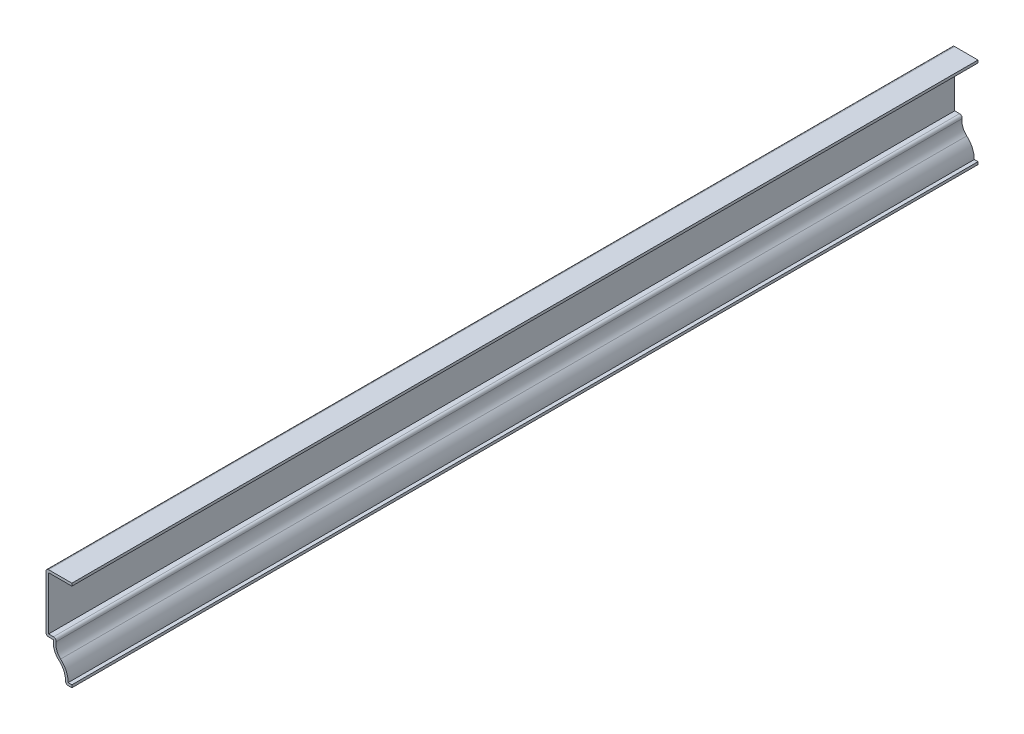
ISO-10303-21;
HEADER;
FILE_DESCRIPTION(('STEP AP214'),'2;1');
FILE_NAME('part.step','',(''),(''),'','','');
FILE_SCHEMA(('AUTOMOTIVE_DESIGN { 1 0 10303 214 1 1 1 1 }'));
ENDSEC;
DATA;
#1=APPLICATION_CONTEXT('core data for automotive mechanical design processes');
#2=APPLICATION_PROTOCOL_DEFINITION('international standard','automotive_design',2000,#1);
#3=PRODUCT_CONTEXT('',#1,'mechanical');
#4=PRODUCT('Part','Part','',(#3));
#5=PRODUCT_RELATED_PRODUCT_CATEGORY('part','',(#4));
#6=PRODUCT_DEFINITION_FORMATION('','',#4);
#7=PRODUCT_DEFINITION_CONTEXT('part definition',#1,'design');
#8=PRODUCT_DEFINITION('design','',#6,#7);
#9=PRODUCT_DEFINITION_SHAPE('','',#8);
#10=(LENGTH_UNIT() NAMED_UNIT(*) SI_UNIT(.MILLI.,.METRE.));
#11=(NAMED_UNIT(*) PLANE_ANGLE_UNIT() SI_UNIT($,.RADIAN.));
#12=(NAMED_UNIT(*) SI_UNIT($,.STERADIAN.) SOLID_ANGLE_UNIT());
#13=UNCERTAINTY_MEASURE_WITH_UNIT(LENGTH_MEASURE(1.E-05),#10,'distance_accuracy_value','');
#14=(GEOMETRIC_REPRESENTATION_CONTEXT(3) GLOBAL_UNCERTAINTY_ASSIGNED_CONTEXT((#13)) GLOBAL_UNIT_ASSIGNED_CONTEXT((#10,
#11,#12)) REPRESENTATION_CONTEXT('',''));
#15=CARTESIAN_POINT('',(0.,0.,0.));
#16=DIRECTION('',(0.,0.,1.));
#17=DIRECTION('',(1.,0.,0.));
#18=AXIS2_PLACEMENT_3D('',#15,#16,#17);
#19=CARTESIAN_POINT('',(-12.7,43.18,-444.5));
#20=DIRECTION('',(0.,-1.,0.));
#21=DIRECTION('',(0.,0.,-1.));
#22=AXIS2_PLACEMENT_3D('',#19,#20,#21);
#23=PLANE('',#22);
#24=DIRECTION('',(1.,0.,0.));
#25=VECTOR('',#24,1.);
#26=CARTESIAN_POINT('',(-12.7,43.18,0.));
#27=LINE('',#26,#25);
#28=CARTESIAN_POINT('',(-11.43,43.18,0.));
#29=VERTEX_POINT('',#28);
#30=CARTESIAN_POINT('',(0.,43.18,0.));
#31=VERTEX_POINT('',#30);
#32=EDGE_CURVE('E218',#29,#31,#27,.T.);
#33=ORIENTED_EDGE('',*,*,#32,.F.);
#34=DIRECTION('',(0.,0.,1.));
#35=VECTOR('',#34,1.);
#36=CARTESIAN_POINT('',(-11.43,43.18,-444.5));
#37=LINE('',#36,#35);
#38=CARTESIAN_POINT('',(-11.43,43.18,-444.5));
#39=VERTEX_POINT('',#38);
#40=EDGE_CURVE('E185',#39,#29,#37,.T.);
#41=ORIENTED_EDGE('',*,*,#40,.F.);
#42=DIRECTION('',(1.,0.,0.));
#43=VECTOR('',#42,1.);
#44=CARTESIAN_POINT('',(-12.7,43.18,-444.5));
#45=LINE('',#44,#43);
#46=CARTESIAN_POINT('',(0.,43.18,-444.5));
#47=VERTEX_POINT('',#46);
#48=EDGE_CURVE('E167',#39,#47,#45,.T.);
#49=ORIENTED_EDGE('',*,*,#48,.T.);
#50=DIRECTION('',(0.,0.,1.));
#51=VECTOR('',#50,1.);
#52=CARTESIAN_POINT('',(0.,43.18,-444.5));
#53=LINE('',#52,#51);
#54=EDGE_CURVE('E175',#47,#31,#53,.T.);
#55=ORIENTED_EDGE('',*,*,#54,.T.);
#56=EDGE_LOOP('',(#33,#41,#49,#55));
#57=FACE_BOUND('',#56,.T.);
#58=ADVANCED_FACE('F35',(#57),#23,.T.);
#59=CARTESIAN_POINT('',(-11.43,15.875,-444.5));
#60=DIRECTION('',(1.,0.,0.));
#61=DIRECTION('',(0.,0.,-1.));
#62=AXIS2_PLACEMENT_3D('',#59,#60,#61);
#63=PLANE('',#62);
#64=DIRECTION('',(0.,1.,0.));
#65=VECTOR('',#64,1.);
#66=CARTESIAN_POINT('',(-11.43,15.875,0.));
#67=LINE('',#66,#65);
#68=CARTESIAN_POINT('',(-11.43,17.145,0.));
#69=VERTEX_POINT('',#68);
#70=EDGE_CURVE('E186',#69,#29,#67,.T.);
#71=ORIENTED_EDGE('',*,*,#70,.F.);
#72=DIRECTION('',(0.,0.,1.));
#73=VECTOR('',#72,1.);
#74=CARTESIAN_POINT('',(-11.43,17.145,-444.5));
#75=LINE('',#74,#73);
#76=CARTESIAN_POINT('',(-11.43,17.145,-444.5));
#77=VERTEX_POINT('',#76);
#78=EDGE_CURVE('E249',#77,#69,#75,.T.);
#79=ORIENTED_EDGE('',*,*,#78,.F.);
#80=DIRECTION('',(0.,1.,0.));
#81=VECTOR('',#80,1.);
#82=CARTESIAN_POINT('',(-11.43,15.875,-444.5));
#83=LINE('',#82,#81);
#84=EDGE_CURVE('E183',#77,#39,#83,.T.);
#85=ORIENTED_EDGE('',*,*,#84,.T.);
#86=ORIENTED_EDGE('',*,*,#40,.T.);
#87=EDGE_LOOP('',(#71,#79,#85,#86));
#88=FACE_BOUND('',#87,.T.);
#89=ADVANCED_FACE('F360',(#88),#63,.T.);
#90=CARTESIAN_POINT('',(-9.02839368681122,17.145,-444.5));
#91=DIRECTION('',(0.,1.,0.));
#92=DIRECTION('',(0.,0.,1.));
#93=AXIS2_PLACEMENT_3D('',#90,#91,#92);
#94=PLANE('',#93);
#95=DIRECTION('',(1.,0.,0.));
#96=VECTOR('',#95,1.);
#97=CARTESIAN_POINT('',(-9.02839368681122,17.145,0.));
#98=LINE('',#97,#96);
#99=CARTESIAN_POINT('',(-9.02839368681122,17.145,0.));
#100=VERTEX_POINT('',#99);
#101=EDGE_CURVE('E189',#100,#69,#98,.F.);
#102=ORIENTED_EDGE('',*,*,#101,.F.);
#103=DIRECTION('',(0.,0.,1.));
#104=VECTOR('',#103,1.);
#105=CARTESIAN_POINT('',(-9.02839368681122,17.145,-444.5));
#106=LINE('',#105,#104);
#107=CARTESIAN_POINT('',(-9.02839368681122,17.145,-444.5));
#108=VERTEX_POINT('',#107);
#109=EDGE_CURVE('E43',#100,#108,#106,.F.);
#110=ORIENTED_EDGE('',*,*,#109,.T.);
#111=DIRECTION('',(1.,0.,0.));
#112=VECTOR('',#111,1.);
#113=CARTESIAN_POINT('',(-9.02839368681122,17.145,-444.5));
#114=LINE('',#113,#112);
#115=EDGE_CURVE('E215',#108,#77,#114,.F.);
#116=ORIENTED_EDGE('',*,*,#115,.T.);
#117=ORIENTED_EDGE('',*,*,#78,.T.);
#118=EDGE_LOOP('',(#102,#110,#116,#117));
#119=FACE_BOUND('',#118,.T.);
#120=ADVANCED_FACE('F299',(#119),#94,.T.);
#121=CARTESIAN_POINT('',(-0.992032718940465,14.605,-444.5));
#122=DIRECTION('',(0.,0.,1.));
#123=DIRECTION('',(1.,0.,0.));
#124=AXIS2_PLACEMENT_3D('',#121,#122,#123);
#125=CYLINDRICAL_SURFACE('',#124,6.86609228105954);
#126=CARTESIAN_POINT('',(-0.992032718940465,14.605,-444.5));
#127=DIRECTION('',(0.,0.,1.));
#128=DIRECTION('',(1.,0.,0.));
#129=AXIS2_PLACEMENT_3D('',#126,#127,#128);
#130=CIRCLE('',#129,6.86609228105954);
#131=CARTESIAN_POINT('',(-5.5221107887271,9.44538607125848,-444.5));
#132=VERTEX_POINT('',#131);
#133=CARTESIAN_POINT('',(-7.7739612053907,15.6767598689539,-444.5));
#134=VERTEX_POINT('',#133);
#135=EDGE_CURVE('E212',#132,#134,#130,.F.);
#136=ORIENTED_EDGE('',*,*,#135,.T.);
#137=DIRECTION('',(0.,0.,1.));
#138=VECTOR('',#137,1.);
#139=CARTESIAN_POINT('',(-7.7739612053907,15.6767598689539,-444.5));
#140=LINE('',#139,#138);
#141=CARTESIAN_POINT('',(-7.7739612053907,15.6767598689539,0.));
#142=VERTEX_POINT('',#141);
#143=EDGE_CURVE('E293',#134,#142,#140,.T.);
#144=ORIENTED_EDGE('',*,*,#143,.T.);
#145=CARTESIAN_POINT('',(-0.992032718940465,14.605,0.));
#146=DIRECTION('',(0.,0.,1.));
#147=DIRECTION('',(1.,0.,0.));
#148=AXIS2_PLACEMENT_3D('',#145,#146,#147);
#149=CIRCLE('',#148,6.86609228105954);
#150=CARTESIAN_POINT('',(-5.5221107887271,9.44538607125848,0.));
#151=VERTEX_POINT('',#150);
#152=EDGE_CURVE('E243',#151,#142,#149,.F.);
#153=ORIENTED_EDGE('',*,*,#152,.F.);
#154=DIRECTION('',(0.,0.,1.));
#155=VECTOR('',#154,1.);
#156=CARTESIAN_POINT('',(-5.5221107887271,9.44538607125848,-444.5));
#157=LINE('',#156,#155);
#158=EDGE_CURVE('E252',#132,#151,#157,.T.);
#159=ORIENTED_EDGE('',*,*,#158,.F.);
#160=EDGE_LOOP('',(#136,#144,#153,#159));
#161=FACE_BOUND('',#160,.T.);
#162=ADVANCED_FACE('F308',(#161),#125,.F.);
#163=CARTESIAN_POINT('',(-12.7,1.27,-444.5));
#164=DIRECTION('',(0.,0.,1.));
#165=DIRECTION('',(1.,0.,0.));
#166=AXIS2_PLACEMENT_3D('',#163,#164,#165);
#167=CYLINDRICAL_SURFACE('',#166,10.8792936785177);
#168=CARTESIAN_POINT('',(-12.7,1.27,0.));
#169=DIRECTION('',(0.,0.,1.));
#170=DIRECTION('',(1.,0.,0.));
#171=AXIS2_PLACEMENT_3D('',#168,#169,#170);
#172=CIRCLE('',#171,10.8792936785177);
#173=CARTESIAN_POINT('',(-1.82070632148231,1.27,0.));
#174=VERTEX_POINT('',#173);
#175=EDGE_CURVE('E240',#174,#151,#172,.T.);
#176=ORIENTED_EDGE('',*,*,#175,.F.);
#177=DIRECTION('',(0.,0.,1.));
#178=VECTOR('',#177,1.);
#179=CARTESIAN_POINT('',(-1.82070632148231,1.27,-444.5));
#180=LINE('',#179,#178);
#181=CARTESIAN_POINT('',(-1.82070632148231,1.27,-444.5));
#182=VERTEX_POINT('',#181);
#183=EDGE_CURVE('E254',#182,#174,#180,.T.);
#184=ORIENTED_EDGE('',*,*,#183,.F.);
#185=CARTESIAN_POINT('',(-12.7,1.27,-444.5));
#186=DIRECTION('',(0.,0.,1.));
#187=DIRECTION('',(1.,0.,0.));
#188=AXIS2_PLACEMENT_3D('',#185,#186,#187);
#189=CIRCLE('',#188,10.8792936785177);
#190=EDGE_CURVE('E209',#182,#132,#189,.T.);
#191=ORIENTED_EDGE('',*,*,#190,.T.);
#192=ORIENTED_EDGE('',*,*,#158,.T.);
#193=EDGE_LOOP('',(#176,#184,#191,#192));
#194=FACE_BOUND('',#193,.T.);
#195=ADVANCED_FACE('F316',(#194),#167,.T.);
#196=CARTESIAN_POINT('',(0.,1.27,-444.5));
#197=DIRECTION('',(0.,1.,0.));
#198=DIRECTION('',(-1.,0.,0.));
#199=AXIS2_PLACEMENT_3D('',#196,#197,#198);
#200=PLANE('',#199);
#201=DIRECTION('',(-1.,0.,0.));
#202=VECTOR('',#201,1.);
#203=CARTESIAN_POINT('',(0.,1.27,0.));
#204=LINE('',#203,#202);
#205=CARTESIAN_POINT('',(0.,1.27,0.));
#206=VERTEX_POINT('',#205);
#207=EDGE_CURVE('E237',#206,#174,#204,.T.);
#208=ORIENTED_EDGE('',*,*,#207,.F.);
#209=DIRECTION('',(0.,0.,1.));
#210=VECTOR('',#209,1.);
#211=CARTESIAN_POINT('',(0.,1.27,-444.5));
#212=LINE('',#211,#210);
#213=CARTESIAN_POINT('',(0.,1.27,-444.5));
#214=VERTEX_POINT('',#213);
#215=EDGE_CURVE('E256',#214,#206,#212,.T.);
#216=ORIENTED_EDGE('',*,*,#215,.F.);
#217=DIRECTION('',(-1.,0.,0.));
#218=VECTOR('',#217,1.);
#219=CARTESIAN_POINT('',(0.,1.27,-444.5));
#220=LINE('',#219,#218);
#221=EDGE_CURVE('E206',#214,#182,#220,.T.);
#222=ORIENTED_EDGE('',*,*,#221,.T.);
#223=ORIENTED_EDGE('',*,*,#183,.T.);
#224=EDGE_LOOP('',(#208,#216,#222,#223));
#225=FACE_BOUND('',#224,.T.);
#226=ADVANCED_FACE('F320',(#225),#200,.T.);
#227=CARTESIAN_POINT('',(0.,1.27,-444.5));
#228=DIRECTION('',(-1.,0.,0.));
#229=DIRECTION('',(0.,-1.,0.));
#230=AXIS2_PLACEMENT_3D('',#227,#228,#229);
#231=PLANE('',#230);
#232=DIRECTION('',(0.,-1.,0.));
#233=VECTOR('',#232,1.);
#234=CARTESIAN_POINT('',(0.,1.27,0.));
#235=LINE('',#234,#233);
#236=CARTESIAN_POINT('',(0.,0.,0.));
#237=VERTEX_POINT('',#236);
#238=EDGE_CURVE('E235',#206,#237,#235,.T.);
#239=ORIENTED_EDGE('',*,*,#238,.T.);
#240=DIRECTION('',(0.,0.,1.));
#241=VECTOR('',#240,1.);
#242=CARTESIAN_POINT('',(0.,0.,-444.5));
#243=LINE('',#242,#241);
#244=CARTESIAN_POINT('',(0.,0.,-444.5));
#245=VERTEX_POINT('',#244);
#246=EDGE_CURVE('E258',#245,#237,#243,.T.);
#247=ORIENTED_EDGE('',*,*,#246,.F.);
#248=DIRECTION('',(0.,-1.,0.));
#249=VECTOR('',#248,1.);
#250=CARTESIAN_POINT('',(0.,1.27,-444.5));
#251=LINE('',#250,#249);
#252=EDGE_CURVE('E204',#214,#245,#251,.T.);
#253=ORIENTED_EDGE('',*,*,#252,.F.);
#254=ORIENTED_EDGE('',*,*,#215,.T.);
#255=EDGE_LOOP('',(#239,#247,#253,#254));
#256=FACE_BOUND('',#255,.T.);
#257=ADVANCED_FACE('F324',(#256),#231,.F.);
#258=CARTESIAN_POINT('',(0.,0.,-444.5));
#259=DIRECTION('',(0.,1.,0.));
#260=DIRECTION('',(-1.,0.,0.));
#261=AXIS2_PLACEMENT_3D('',#258,#259,#260);
#262=PLANE('',#261);
#263=DIRECTION('',(-1.,0.,0.));
#264=VECTOR('',#263,1.);
#265=CARTESIAN_POINT('',(0.,0.,0.));
#266=LINE('',#265,#264);
#267=CARTESIAN_POINT('',(-1.82070632148231,0.,0.));
#268=VERTEX_POINT('',#267);
#269=EDGE_CURVE('E232',#237,#268,#266,.T.);
#270=ORIENTED_EDGE('',*,*,#269,.T.);
#271=DIRECTION('',(0.,0.,1.));
#272=VECTOR('',#271,1.);
#273=CARTESIAN_POINT('',(-1.82070632148231,0.,-444.5));
#274=LINE('',#273,#272);
#275=CARTESIAN_POINT('',(-1.82070632148231,0.,-444.5));
#276=VERTEX_POINT('',#275);
#277=EDGE_CURVE('E278',#268,#276,#274,.F.);
#278=ORIENTED_EDGE('',*,*,#277,.T.);
#279=DIRECTION('',(-1.,0.,0.));
#280=VECTOR('',#279,1.);
#281=CARTESIAN_POINT('',(0.,0.,-444.5));
#282=LINE('',#281,#280);
#283=EDGE_CURVE('E202',#245,#276,#282,.T.);
#284=ORIENTED_EDGE('',*,*,#283,.F.);
#285=ORIENTED_EDGE('',*,*,#246,.T.);
#286=EDGE_LOOP('',(#270,#278,#284,#285));
#287=FACE_BOUND('',#286,.T.);
#288=ADVANCED_FACE('F380',(#287),#262,.F.);
#289=CARTESIAN_POINT('',(-12.7,1.27,-444.5));
#290=DIRECTION('',(0.,0.,1.));
#291=DIRECTION('',(1.,0.,0.));
#292=AXIS2_PLACEMENT_3D('',#289,#290,#291);
#293=CYLINDRICAL_SURFACE('',#292,9.60929367851769);
#294=CARTESIAN_POINT('',(-12.7,1.27,-444.5));
#295=DIRECTION('',(0.,0.,1.));
#296=DIRECTION('',(1.,0.,0.));
#297=AXIS2_PLACEMENT_3D('',#294,#295,#296);
#298=CIRCLE('',#297,9.60929367851769);
#299=CARTESIAN_POINT('',(-3.09070632148231,1.27,-444.5));
#300=VERTEX_POINT('',#299);
#301=CARTESIAN_POINT('',(-6.36002541514416,8.49102813063223,-444.5));
#302=VERTEX_POINT('',#301);
#303=EDGE_CURVE('E200',#300,#302,#298,.T.);
#304=ORIENTED_EDGE('',*,*,#303,.F.);
#305=DIRECTION('',(0.,0.,1.));
#306=VECTOR('',#305,1.);
#307=CARTESIAN_POINT('',(-3.09070632148231,1.27,-444.5));
#308=LINE('',#307,#306);
#309=CARTESIAN_POINT('',(-3.09070632148231,1.27,0.));
#310=VERTEX_POINT('',#309);
#311=EDGE_CURVE('E248',#300,#310,#308,.T.);
#312=ORIENTED_EDGE('',*,*,#311,.T.);
#313=CARTESIAN_POINT('',(-12.7,1.27,0.));
#314=DIRECTION('',(0.,0.,1.));
#315=DIRECTION('',(1.,0.,0.));
#316=AXIS2_PLACEMENT_3D('',#313,#314,#315);
#317=CIRCLE('',#316,9.60929367851769);
#318=CARTESIAN_POINT('',(-6.36002541514416,8.49102813063223,0.));
#319=VERTEX_POINT('',#318);
#320=EDGE_CURVE('E230',#310,#319,#317,.T.);
#321=ORIENTED_EDGE('',*,*,#320,.T.);
#322=DIRECTION('',(0.,0.,1.));
#323=VECTOR('',#322,1.);
#324=CARTESIAN_POINT('',(-6.36002541514416,8.49102813063223,-444.5));
#325=LINE('',#324,#323);
#326=EDGE_CURVE('E261',#302,#319,#325,.T.);
#327=ORIENTED_EDGE('',*,*,#326,.F.);
#328=EDGE_LOOP('',(#304,#312,#321,#327));
#329=FACE_BOUND('',#328,.T.);
#330=ADVANCED_FACE('F334',(#329),#293,.F.);
#331=CARTESIAN_POINT('',(-0.992032718940465,14.605,-444.5));
#332=DIRECTION('',(0.,0.,1.));
#333=DIRECTION('',(1.,0.,0.));
#334=AXIS2_PLACEMENT_3D('',#331,#332,#333);
#335=CYLINDRICAL_SURFACE('',#334,8.13609228105954);
#336=CARTESIAN_POINT('',(-0.992032718940465,14.605,0.));
#337=DIRECTION('',(0.,0.,-1.));
#338=DIRECTION('',(-1.,0.,0.));
#339=AXIS2_PLACEMENT_3D('',#336,#337,#338);
#340=CIRCLE('',#339,8.13609228105954);
#341=CARTESIAN_POINT('',(-9.02839368681122,15.875,0.));
#342=VERTEX_POINT('',#341);
#343=EDGE_CURVE('E228',#319,#342,#340,.T.);
#344=ORIENTED_EDGE('',*,*,#343,.T.);
#345=DIRECTION('',(0.,0.,1.));
#346=VECTOR('',#345,1.);
#347=CARTESIAN_POINT('',(-9.02839368681122,15.875,-444.5));
#348=LINE('',#347,#346);
#349=CARTESIAN_POINT('',(-9.02839368681122,15.875,-444.5));
#350=VERTEX_POINT('',#349);
#351=EDGE_CURVE('E264',#350,#342,#348,.T.);
#352=ORIENTED_EDGE('',*,*,#351,.F.);
#353=CARTESIAN_POINT('',(-0.992032718940465,14.605,-444.5));
#354=DIRECTION('',(0.,0.,-1.));
#355=DIRECTION('',(-1.,0.,0.));
#356=AXIS2_PLACEMENT_3D('',#353,#354,#355);
#357=CIRCLE('',#356,8.13609228105954);
#358=EDGE_CURVE('E198',#302,#350,#357,.T.);
#359=ORIENTED_EDGE('',*,*,#358,.F.);
#360=ORIENTED_EDGE('',*,*,#326,.T.);
#361=EDGE_LOOP('',(#344,#352,#359,#360));
#362=FACE_BOUND('',#361,.T.);
#363=ADVANCED_FACE('F341',(#362),#335,.T.);
#364=CARTESIAN_POINT('',(-9.02839368681122,15.875,-444.5));
#365=DIRECTION('',(0.,1.,0.));
#366=DIRECTION('',(0.,0.,1.));
#367=AXIS2_PLACEMENT_3D('',#364,#365,#366);
#368=PLANE('',#367);
#369=DIRECTION('',(-1.,0.,0.));
#370=VECTOR('',#369,1.);
#371=CARTESIAN_POINT('',(-9.02839368681122,15.875,0.));
#372=LINE('',#371,#370);
#373=CARTESIAN_POINT('',(-11.43,15.875,0.));
#374=VERTEX_POINT('',#373);
#375=EDGE_CURVE('E225',#342,#374,#372,.T.);
#376=ORIENTED_EDGE('',*,*,#375,.T.);
#377=DIRECTION('',(0.,0.,1.));
#378=VECTOR('',#377,1.);
#379=CARTESIAN_POINT('',(-11.43,15.875,-444.5));
#380=LINE('',#379,#378);
#381=CARTESIAN_POINT('',(-11.43,15.875,-444.5));
#382=VERTEX_POINT('',#381);
#383=EDGE_CURVE('E291',#374,#382,#380,.F.);
#384=ORIENTED_EDGE('',*,*,#383,.T.);
#385=DIRECTION('',(-1.,0.,0.));
#386=VECTOR('',#385,1.);
#387=CARTESIAN_POINT('',(-9.02839368681122,15.875,-444.5));
#388=LINE('',#387,#386);
#389=EDGE_CURVE('E195',#350,#382,#388,.T.);
#390=ORIENTED_EDGE('',*,*,#389,.F.);
#391=ORIENTED_EDGE('',*,*,#351,.T.);
#392=EDGE_LOOP('',(#376,#384,#390,#391));
#393=FACE_BOUND('',#392,.T.);
#394=ADVANCED_FACE('F345',(#393),#368,.F.);
#395=CARTESIAN_POINT('',(-12.7,15.875,-444.5));
#396=DIRECTION('',(1.,0.,0.));
#397=DIRECTION('',(0.,0.,-1.));
#398=AXIS2_PLACEMENT_3D('',#395,#396,#397);
#399=PLANE('',#398);
#400=DIRECTION('',(0.,1.,0.));
#401=VECTOR('',#400,1.);
#402=CARTESIAN_POINT('',(-12.7,15.875,-444.5));
#403=LINE('',#402,#401);
#404=CARTESIAN_POINT('',(-12.7,17.145,-444.5));
#405=VERTEX_POINT('',#404);
#406=CARTESIAN_POINT('',(-12.7,43.18,-444.5));
#407=VERTEX_POINT('',#406);
#408=EDGE_CURVE('E193',#405,#407,#403,.T.);
#409=ORIENTED_EDGE('',*,*,#408,.F.);
#410=DIRECTION('',(0.,0.,1.));
#411=VECTOR('',#410,1.);
#412=CARTESIAN_POINT('',(-12.7,17.145,-444.5));
#413=LINE('',#412,#411);
#414=CARTESIAN_POINT('',(-12.7,17.145,0.));
#415=VERTEX_POINT('',#414);
#416=EDGE_CURVE('E288',#405,#415,#413,.T.);
#417=ORIENTED_EDGE('',*,*,#416,.T.);
#418=DIRECTION('',(0.,1.,0.));
#419=VECTOR('',#418,1.);
#420=CARTESIAN_POINT('',(-12.7,15.875,0.));
#421=LINE('',#420,#419);
#422=CARTESIAN_POINT('',(-12.7,43.18,0.));
#423=VERTEX_POINT('',#422);
#424=EDGE_CURVE('E223',#415,#423,#421,.T.);
#425=ORIENTED_EDGE('',*,*,#424,.T.);
#426=DIRECTION('',(0.,0.,1.));
#427=VECTOR('',#426,1.);
#428=CARTESIAN_POINT('',(-12.7,43.18,-444.5));
#429=LINE('',#428,#427);
#430=EDGE_CURVE('E58',#423,#407,#429,.F.);
#431=ORIENTED_EDGE('',*,*,#430,.T.);
#432=EDGE_LOOP('',(#409,#417,#425,#431));
#433=FACE_BOUND('',#432,.T.);
#434=ADVANCED_FACE('F352',(#433),#399,.F.);
#435=CARTESIAN_POINT('',(-12.7,44.45,-444.5));
#436=DIRECTION('',(0.,-1.,0.));
#437=DIRECTION('',(0.,0.,-1.));
#438=AXIS2_PLACEMENT_3D('',#435,#436,#437);
#439=PLANE('',#438);
#440=DIRECTION('',(1.,0.,0.));
#441=VECTOR('',#440,1.);
#442=CARTESIAN_POINT('',(-12.7,44.45,-444.5));
#443=LINE('',#442,#441);
#444=CARTESIAN_POINT('',(-11.43,44.45,-444.5));
#445=VERTEX_POINT('',#444);
#446=CARTESIAN_POINT('',(0.,44.45,-444.5));
#447=VERTEX_POINT('',#446);
#448=EDGE_CURVE('E169',#445,#447,#443,.T.);
#449=ORIENTED_EDGE('',*,*,#448,.F.);
#450=DIRECTION('',(0.,0.,1.));
#451=VECTOR('',#450,1.);
#452=CARTESIAN_POINT('',(-11.43,44.45,-444.5));
#453=LINE('',#452,#451);
#454=CARTESIAN_POINT('',(-11.43,44.45,0.));
#455=VERTEX_POINT('',#454);
#456=EDGE_CURVE('E11',#445,#455,#453,.T.);
#457=ORIENTED_EDGE('',*,*,#456,.T.);
#458=DIRECTION('',(1.,0.,0.));
#459=VECTOR('',#458,1.);
#460=CARTESIAN_POINT('',(-12.7,44.45,0.));
#461=LINE('',#460,#459);
#462=CARTESIAN_POINT('',(0.,44.45,0.));
#463=VERTEX_POINT('',#462);
#464=EDGE_CURVE('E221',#455,#463,#461,.T.);
#465=ORIENTED_EDGE('',*,*,#464,.T.);
#466=DIRECTION('',(0.,0.,1.));
#467=VECTOR('',#466,1.);
#468=CARTESIAN_POINT('',(0.,44.45,-444.5));
#469=LINE('',#468,#467);
#470=EDGE_CURVE('E182',#447,#463,#469,.T.);
#471=ORIENTED_EDGE('',*,*,#470,.F.);
#472=EDGE_LOOP('',(#449,#457,#465,#471));
#473=FACE_BOUND('',#472,.T.);
#474=ADVANCED_FACE('F357',(#473),#439,.F.);
#475=CARTESIAN_POINT('',(0.,44.45,-444.5));
#476=DIRECTION('',(-1.,0.,0.));
#477=DIRECTION('',(0.,0.,1.));
#478=AXIS2_PLACEMENT_3D('',#475,#476,#477);
#479=PLANE('',#478);
#480=DIRECTION('',(0.,-1.,0.));
#481=VECTOR('',#480,1.);
#482=CARTESIAN_POINT('',(0.,44.45,0.));
#483=LINE('',#482,#481);
#484=EDGE_CURVE('E178',#463,#31,#483,.T.);
#485=ORIENTED_EDGE('',*,*,#484,.T.);
#486=ORIENTED_EDGE('',*,*,#54,.F.);
#487=DIRECTION('',(0.,-1.,0.));
#488=VECTOR('',#487,1.);
#489=CARTESIAN_POINT('',(0.,44.45,-444.5));
#490=LINE('',#489,#488);
#491=EDGE_CURVE('E161',#447,#47,#490,.T.);
#492=ORIENTED_EDGE('',*,*,#491,.F.);
#493=ORIENTED_EDGE('',*,*,#470,.T.);
#494=EDGE_LOOP('',(#485,#486,#492,#493));
#495=FACE_BOUND('',#494,.T.);
#496=ADVANCED_FACE('F176',(#495),#479,.F.);
#497=CARTESIAN_POINT('',(-0.992032718940465,14.605,-444.5));
#498=DIRECTION('',(0.,0.,-1.));
#499=DIRECTION('',(-1.,0.,0.));
#500=AXIS2_PLACEMENT_3D('',#497,#498,#499);
#501=PLANE('',#500);
#502=ORIENTED_EDGE('',*,*,#283,.T.);
#503=CARTESIAN_POINT('',(-1.82070632148231,1.27,-444.5));
#504=DIRECTION('',(0.,0.,-1.));
#505=DIRECTION('',(-1.,0.,0.));
#506=AXIS2_PLACEMENT_3D('',#503,#504,#505);
#507=CIRCLE('',#506,1.27);
#508=EDGE_CURVE('E285',#276,#300,#507,.T.);
#509=ORIENTED_EDGE('',*,*,#508,.T.);
#510=ORIENTED_EDGE('',*,*,#303,.T.);
#511=ORIENTED_EDGE('',*,*,#358,.T.);
#512=ORIENTED_EDGE('',*,*,#389,.T.);
#513=CARTESIAN_POINT('',(-11.43,17.145,-444.5));
#514=DIRECTION('',(0.,0.,-1.));
#515=DIRECTION('',(-1.,0.,0.));
#516=AXIS2_PLACEMENT_3D('',#513,#514,#515);
#517=CIRCLE('',#516,1.27);
#518=EDGE_CURVE('E283',#382,#405,#517,.T.);
#519=ORIENTED_EDGE('',*,*,#518,.T.);
#520=ORIENTED_EDGE('',*,*,#408,.T.);
#521=CARTESIAN_POINT('',(-11.43,43.18,-444.5));
#522=DIRECTION('',(0.,0.,-1.));
#523=DIRECTION('',(-1.,0.,0.));
#524=AXIS2_PLACEMENT_3D('',#521,#522,#523);
#525=CIRCLE('',#524,1.27);
#526=EDGE_CURVE('E50',#407,#445,#525,.T.);
#527=ORIENTED_EDGE('',*,*,#526,.T.);
#528=ORIENTED_EDGE('',*,*,#448,.T.);
#529=ORIENTED_EDGE('',*,*,#491,.T.);
#530=ORIENTED_EDGE('',*,*,#48,.F.);
#531=ORIENTED_EDGE('',*,*,#84,.F.);
#532=ORIENTED_EDGE('',*,*,#115,.F.);
#533=CARTESIAN_POINT('',(-9.02839368681122,15.875,-444.5));
#534=DIRECTION('',(0.,0.,-1.));
#535=DIRECTION('',(-1.,0.,0.));
#536=AXIS2_PLACEMENT_3D('',#533,#534,#535);
#537=CIRCLE('',#536,1.27);
#538=EDGE_CURVE('E281',#108,#134,#537,.T.);
#539=ORIENTED_EDGE('',*,*,#538,.T.);
#540=ORIENTED_EDGE('',*,*,#135,.F.);
#541=ORIENTED_EDGE('',*,*,#190,.F.);
#542=ORIENTED_EDGE('',*,*,#221,.F.);
#543=ORIENTED_EDGE('',*,*,#252,.T.);
#544=EDGE_LOOP('',(#502,#509,#510,#511,#512,#519,#520,#527,#528,#529,#530,#531,#532,#539,#540,
#541,#542,#543));
#545=FACE_BOUND('',#544,.T.);
#546=ADVANCED_FACE('F164',(#545),#501,.T.);
#547=CARTESIAN_POINT('',(-0.992032718940465,14.605,0.));
#548=DIRECTION('',(0.,0.,-1.));
#549=DIRECTION('',(-1.,0.,0.));
#550=AXIS2_PLACEMENT_3D('',#547,#548,#549);
#551=PLANE('',#550);
#552=ORIENTED_EDGE('',*,*,#320,.F.);
#553=CARTESIAN_POINT('',(-1.82070632148231,1.27,0.));
#554=DIRECTION('',(0.,0.,-1.));
#555=DIRECTION('',(-1.,0.,0.));
#556=AXIS2_PLACEMENT_3D('',#553,#554,#555);
#557=CIRCLE('',#556,1.27);
#558=EDGE_CURVE('E276',#310,#268,#557,.F.);
#559=ORIENTED_EDGE('',*,*,#558,.T.);
#560=ORIENTED_EDGE('',*,*,#269,.F.);
#561=ORIENTED_EDGE('',*,*,#238,.F.);
#562=ORIENTED_EDGE('',*,*,#207,.T.);
#563=ORIENTED_EDGE('',*,*,#175,.T.);
#564=ORIENTED_EDGE('',*,*,#152,.T.);
#565=CARTESIAN_POINT('',(-9.02839368681122,15.875,0.));
#566=DIRECTION('',(0.,0.,-1.));
#567=DIRECTION('',(-1.,0.,0.));
#568=AXIS2_PLACEMENT_3D('',#565,#566,#567);
#569=CIRCLE('',#568,1.27);
#570=EDGE_CURVE('E272',#142,#100,#569,.F.);
#571=ORIENTED_EDGE('',*,*,#570,.T.);
#572=ORIENTED_EDGE('',*,*,#101,.T.);
#573=ORIENTED_EDGE('',*,*,#70,.T.);
#574=ORIENTED_EDGE('',*,*,#32,.T.);
#575=ORIENTED_EDGE('',*,*,#484,.F.);
#576=ORIENTED_EDGE('',*,*,#464,.F.);
#577=CARTESIAN_POINT('',(-11.43,43.18,0.));
#578=DIRECTION('',(0.,0.,-1.));
#579=DIRECTION('',(-1.,0.,0.));
#580=AXIS2_PLACEMENT_3D('',#577,#578,#579);
#581=CIRCLE('',#580,1.27);
#582=EDGE_CURVE('E270',#455,#423,#581,.F.);
#583=ORIENTED_EDGE('',*,*,#582,.T.);
#584=ORIENTED_EDGE('',*,*,#424,.F.);
#585=CARTESIAN_POINT('',(-11.43,17.145,0.));
#586=DIRECTION('',(0.,0.,-1.));
#587=DIRECTION('',(-1.,0.,0.));
#588=AXIS2_PLACEMENT_3D('',#585,#586,#587);
#589=CIRCLE('',#588,1.27);
#590=EDGE_CURVE('E274',#415,#374,#589,.F.);
#591=ORIENTED_EDGE('',*,*,#590,.T.);
#592=ORIENTED_EDGE('',*,*,#375,.F.);
#593=ORIENTED_EDGE('',*,*,#343,.F.);
#594=EDGE_LOOP('',(#552,#559,#560,#561,#562,#563,#564,#571,#572,#573,#574,#575,#576,#583,#584,
#591,#592,#593));
#595=FACE_BOUND('',#594,.T.);
#596=ADVANCED_FACE('F311',(#595),#551,.F.);
#597=CARTESIAN_POINT('',(-1.82070632148231,1.27,-444.5));
#598=DIRECTION('',(0.,0.,1.));
#599=DIRECTION('',(1.,0.,0.));
#600=AXIS2_PLACEMENT_3D('',#597,#598,#599);
#601=CYLINDRICAL_SURFACE('',#600,1.27);
#602=ORIENTED_EDGE('',*,*,#508,.F.);
#603=ORIENTED_EDGE('',*,*,#277,.F.);
#604=ORIENTED_EDGE('',*,*,#558,.F.);
#605=ORIENTED_EDGE('',*,*,#311,.F.);
#606=EDGE_LOOP('',(#602,#603,#604,#605));
#607=FACE_BOUND('',#606,.T.);
#608=ADVANCED_FACE('F332',(#607),#601,.T.);
#609=CARTESIAN_POINT('',(-11.43,17.145,-444.5));
#610=DIRECTION('',(0.,0.,1.));
#611=DIRECTION('',(1.,0.,0.));
#612=AXIS2_PLACEMENT_3D('',#609,#610,#611);
#613=CYLINDRICAL_SURFACE('',#612,1.27);
#614=ORIENTED_EDGE('',*,*,#518,.F.);
#615=ORIENTED_EDGE('',*,*,#383,.F.);
#616=ORIENTED_EDGE('',*,*,#590,.F.);
#617=ORIENTED_EDGE('',*,*,#416,.F.);
#618=EDGE_LOOP('',(#614,#615,#616,#617));
#619=FACE_BOUND('',#618,.T.);
#620=ADVANCED_FACE('F350',(#619),#613,.T.);
#621=CARTESIAN_POINT('',(-9.02839368681122,15.875,-444.5));
#622=DIRECTION('',(0.,0.,1.));
#623=DIRECTION('',(1.,0.,0.));
#624=AXIS2_PLACEMENT_3D('',#621,#622,#623);
#625=CYLINDRICAL_SURFACE('',#624,1.27);
#626=ORIENTED_EDGE('',*,*,#538,.F.);
#627=ORIENTED_EDGE('',*,*,#109,.F.);
#628=ORIENTED_EDGE('',*,*,#570,.F.);
#629=ORIENTED_EDGE('',*,*,#143,.F.);
#630=EDGE_LOOP('',(#626,#627,#628,#629));
#631=FACE_BOUND('',#630,.T.);
#632=ADVANCED_FACE('F305',(#631),#625,.T.);
#633=CARTESIAN_POINT('',(-11.43,43.18,-444.5));
#634=DIRECTION('',(0.,0.,1.));
#635=DIRECTION('',(1.,0.,0.));
#636=AXIS2_PLACEMENT_3D('',#633,#634,#635);
#637=CYLINDRICAL_SURFACE('',#636,1.27);
#638=ORIENTED_EDGE('',*,*,#526,.F.);
#639=ORIENTED_EDGE('',*,*,#430,.F.);
#640=ORIENTED_EDGE('',*,*,#582,.F.);
#641=ORIENTED_EDGE('',*,*,#456,.F.);
#642=EDGE_LOOP('',(#638,#639,#640,#641));
#643=FACE_BOUND('',#642,.T.);
#644=ADVANCED_FACE('F37',(#643),#637,.T.);
#645=CLOSED_SHELL('',(#58,#89,#120,#162,#195,#226,#257,#288,#330,#363,#394,#434,#474,#496,#546,
#596,#608,#620,#632,#644));
#646=MANIFOLD_SOLID_BREP('B2',#645);
#647=ADVANCED_BREP_SHAPE_REPRESENTATION('',(#18,#646),#14);
#648=SHAPE_DEFINITION_REPRESENTATION(#9,#647);
ENDSEC;
END-ISO-10303-21;
